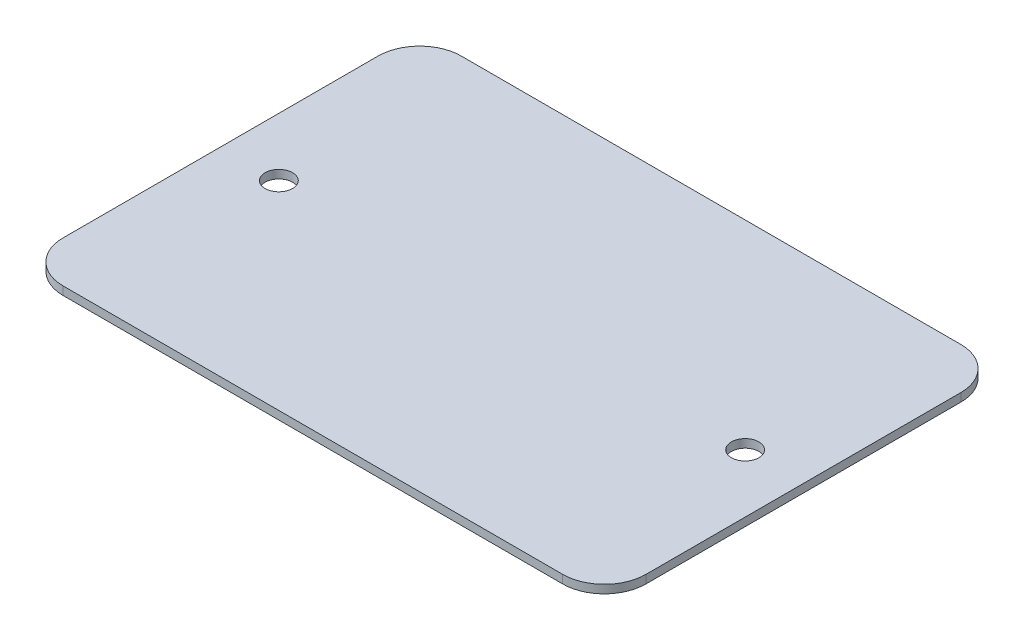
ISO-10303-21;
HEADER;
FILE_DESCRIPTION(('STEP AP214'),'2;1');
FILE_NAME('part.step','',(''),(''),'','','');
FILE_SCHEMA(('AUTOMOTIVE_DESIGN { 1 0 10303 214 1 1 1 1 }'));
ENDSEC;
DATA;
#1=APPLICATION_CONTEXT('core data for automotive mechanical design processes');
#2=APPLICATION_PROTOCOL_DEFINITION('international standard','automotive_design',2000,#1);
#3=PRODUCT_CONTEXT('',#1,'mechanical');
#4=PRODUCT('Part','Part','',(#3));
#5=PRODUCT_RELATED_PRODUCT_CATEGORY('part','',(#4));
#6=PRODUCT_DEFINITION_FORMATION('','',#4);
#7=PRODUCT_DEFINITION_CONTEXT('part definition',#1,'design');
#8=PRODUCT_DEFINITION('design','',#6,#7);
#9=PRODUCT_DEFINITION_SHAPE('','',#8);
#10=(LENGTH_UNIT() NAMED_UNIT(*) SI_UNIT(.MILLI.,.METRE.));
#11=(NAMED_UNIT(*) PLANE_ANGLE_UNIT() SI_UNIT($,.RADIAN.));
#12=(NAMED_UNIT(*) SI_UNIT($,.STERADIAN.) SOLID_ANGLE_UNIT());
#13=UNCERTAINTY_MEASURE_WITH_UNIT(LENGTH_MEASURE(1.E-05),#10,'distance_accuracy_value','');
#14=(GEOMETRIC_REPRESENTATION_CONTEXT(3) GLOBAL_UNCERTAINTY_ASSIGNED_CONTEXT((#13)) GLOBAL_UNIT_ASSIGNED_CONTEXT((#10,
#11,#12)) REPRESENTATION_CONTEXT('',''));
#15=CARTESIAN_POINT('',(0.,0.,0.));
#16=DIRECTION('',(0.,0.,1.));
#17=DIRECTION('',(1.,0.,0.));
#18=AXIS2_PLACEMENT_3D('',#15,#16,#17);
#19=CARTESIAN_POINT('',(6.10297775867225,1.,0.));
#20=DIRECTION('',(-1.,0.,0.));
#21=DIRECTION('',(0.,0.,1.));
#22=AXIS2_PLACEMENT_3D('',#19,#20,#21);
#23=PLANE('',#22);
#24=DIRECTION('',(0.,0.,-1.));
#25=VECTOR('',#24,1.);
#26=CARTESIAN_POINT('',(6.10297775867225,0.,0.));
#27=LINE('',#26,#25);
#28=CARTESIAN_POINT('',(6.10297775867225,0.,30.5092870943281));
#29=VERTEX_POINT('',#28);
#30=CARTESIAN_POINT('',(6.10297775867225,0.,-7.31135153699148));
#31=VERTEX_POINT('',#30);
#32=EDGE_CURVE('E134',#29,#31,#27,.T.);
#33=ORIENTED_EDGE('',*,*,#32,.T.);
#34=DIRECTION('',(0.,-1.,0.));
#35=VECTOR('',#34,1.);
#36=CARTESIAN_POINT('',(6.10297775867225,1.,-7.31135153699148));
#37=LINE('',#36,#35);
#38=CARTESIAN_POINT('',(6.10297775867225,1.,-7.31135153699148));
#39=VERTEX_POINT('',#38);
#40=EDGE_CURVE('E112',#31,#39,#37,.F.);
#41=ORIENTED_EDGE('',*,*,#40,.T.);
#42=DIRECTION('',(0.,0.,-1.));
#43=VECTOR('',#42,1.);
#44=CARTESIAN_POINT('',(6.10297775867225,1.,0.));
#45=LINE('',#44,#43);
#46=CARTESIAN_POINT('',(6.10297775867225,1.,30.5092870943281));
#47=VERTEX_POINT('',#46);
#48=EDGE_CURVE('E144',#47,#39,#45,.T.);
#49=ORIENTED_EDGE('',*,*,#48,.F.);
#50=DIRECTION('',(0.,-1.,0.));
#51=VECTOR('',#50,1.);
#52=CARTESIAN_POINT('',(6.10297775867225,1.,30.5092870943281));
#53=LINE('',#52,#51);
#54=EDGE_CURVE('E117',#47,#29,#53,.T.);
#55=ORIENTED_EDGE('',*,*,#54,.T.);
#56=EDGE_LOOP('',(#33,#41,#49,#55));
#57=FACE_BOUND('',#56,.T.);
#58=ADVANCED_FACE('F39',(#57),#23,.F.);
#59=CARTESIAN_POINT('',(0.,1.,-12.3113515369915));
#60=DIRECTION('',(0.,0.,1.));
#61=DIRECTION('',(1.,0.,0.));
#62=AXIS2_PLACEMENT_3D('',#59,#60,#61);
#63=PLANE('',#62);
#64=DIRECTION('',(-1.,0.,0.));
#65=VECTOR('',#64,1.);
#66=CARTESIAN_POINT('',(0.,1.,-12.3113515369915));
#67=LINE('',#66,#65);
#68=CARTESIAN_POINT('',(1.10297775867225,1.,-12.3113515369915));
#69=VERTEX_POINT('',#68);
#70=CARTESIAN_POINT('',(-58.8970222413278,1.,-12.3113515369915));
#71=VERTEX_POINT('',#70);
#72=EDGE_CURVE('E127',#69,#71,#67,.T.);
#73=ORIENTED_EDGE('',*,*,#72,.F.);
#74=DIRECTION('',(0.,-1.,0.));
#75=VECTOR('',#74,1.);
#76=CARTESIAN_POINT('',(1.10297775867225,1.,-12.3113515369915));
#77=LINE('',#76,#75);
#78=CARTESIAN_POINT('',(1.10297775867225,0.,-12.3113515369915));
#79=VERTEX_POINT('',#78);
#80=EDGE_CURVE('E111',#69,#79,#77,.T.);
#81=ORIENTED_EDGE('',*,*,#80,.T.);
#82=DIRECTION('',(-1.,0.,0.));
#83=VECTOR('',#82,1.);
#84=CARTESIAN_POINT('',(0.,0.,-12.3113515369915));
#85=LINE('',#84,#83);
#86=CARTESIAN_POINT('',(-58.8970222413278,0.,-12.3113515369915));
#87=VERTEX_POINT('',#86);
#88=EDGE_CURVE('E124',#79,#87,#85,.T.);
#89=ORIENTED_EDGE('',*,*,#88,.T.);
#90=DIRECTION('',(0.,-1.,0.));
#91=VECTOR('',#90,1.);
#92=CARTESIAN_POINT('',(-58.8970222413278,1.,-12.3113515369915));
#93=LINE('',#92,#91);
#94=EDGE_CURVE('E129',#87,#71,#93,.F.);
#95=ORIENTED_EDGE('',*,*,#94,.T.);
#96=EDGE_LOOP('',(#73,#81,#89,#95));
#97=FACE_BOUND('',#96,.T.);
#98=ADVANCED_FACE('F123',(#97),#63,.F.);
#99=CARTESIAN_POINT('',(-63.8970222413278,1.,0.));
#100=DIRECTION('',(1.,0.,0.));
#101=DIRECTION('',(0.,0.,-1.));
#102=AXIS2_PLACEMENT_3D('',#99,#100,#101);
#103=PLANE('',#102);
#104=DIRECTION('',(0.,0.,1.));
#105=VECTOR('',#104,1.);
#106=CARTESIAN_POINT('',(-63.8970222413278,1.,0.));
#107=LINE('',#106,#105);
#108=CARTESIAN_POINT('',(-63.8970222413278,1.,-7.31135153699148));
#109=VERTEX_POINT('',#108);
#110=CARTESIAN_POINT('',(-63.8970222413278,1.,30.5092870943281));
#111=VERTEX_POINT('',#110);
#112=EDGE_CURVE('E181',#109,#111,#107,.T.);
#113=ORIENTED_EDGE('',*,*,#112,.F.);
#114=DIRECTION('',(0.,-1.,0.));
#115=VECTOR('',#114,1.);
#116=CARTESIAN_POINT('',(-63.8970222413278,1.,-7.31135153699148));
#117=LINE('',#116,#115);
#118=CARTESIAN_POINT('',(-63.8970222413278,0.,-7.31135153699148));
#119=VERTEX_POINT('',#118);
#120=EDGE_CURVE('E163',#109,#119,#117,.T.);
#121=ORIENTED_EDGE('',*,*,#120,.T.);
#122=DIRECTION('',(0.,0.,1.));
#123=VECTOR('',#122,1.);
#124=CARTESIAN_POINT('',(-63.8970222413278,0.,0.));
#125=LINE('',#124,#123);
#126=CARTESIAN_POINT('',(-63.8970222413278,0.,30.5092870943281));
#127=VERTEX_POINT('',#126);
#128=EDGE_CURVE('E133',#119,#127,#125,.T.);
#129=ORIENTED_EDGE('',*,*,#128,.T.);
#130=DIRECTION('',(0.,-1.,0.));
#131=VECTOR('',#130,1.);
#132=CARTESIAN_POINT('',(-63.8970222413278,1.,30.5092870943281));
#133=LINE('',#132,#131);
#134=EDGE_CURVE('E161',#127,#111,#133,.F.);
#135=ORIENTED_EDGE('',*,*,#134,.T.);
#136=EDGE_LOOP('',(#113,#121,#129,#135));
#137=FACE_BOUND('',#136,.T.);
#138=ADVANCED_FACE('F196',(#137),#103,.F.);
#139=CARTESIAN_POINT('',(0.,1.,35.5092870943281));
#140=DIRECTION('',(0.,0.,-1.));
#141=DIRECTION('',(-1.,0.,0.));
#142=AXIS2_PLACEMENT_3D('',#139,#140,#141);
#143=PLANE('',#142);
#144=DIRECTION('',(1.,0.,0.));
#145=VECTOR('',#144,1.);
#146=CARTESIAN_POINT('',(0.,1.,35.5092870943281));
#147=LINE('',#146,#145);
#148=CARTESIAN_POINT('',(-58.8970222413278,1.,35.5092870943281));
#149=VERTEX_POINT('',#148);
#150=CARTESIAN_POINT('',(1.10297775867225,1.,35.5092870943281));
#151=VERTEX_POINT('',#150);
#152=EDGE_CURVE('E145',#149,#151,#147,.T.);
#153=ORIENTED_EDGE('',*,*,#152,.F.);
#154=DIRECTION('',(0.,-1.,0.));
#155=VECTOR('',#154,1.);
#156=CARTESIAN_POINT('',(-58.8970222413278,1.,35.5092870943281));
#157=LINE('',#156,#155);
#158=CARTESIAN_POINT('',(-58.8970222413278,0.,35.5092870943281));
#159=VERTEX_POINT('',#158);
#160=EDGE_CURVE('E11',#149,#159,#157,.T.);
#161=ORIENTED_EDGE('',*,*,#160,.T.);
#162=DIRECTION('',(1.,0.,0.));
#163=VECTOR('',#162,1.);
#164=CARTESIAN_POINT('',(0.,0.,35.5092870943281));
#165=LINE('',#164,#163);
#166=CARTESIAN_POINT('',(1.10297775867225,0.,35.5092870943281));
#167=VERTEX_POINT('',#166);
#168=EDGE_CURVE('E137',#159,#167,#165,.T.);
#169=ORIENTED_EDGE('',*,*,#168,.T.);
#170=DIRECTION('',(0.,-1.,0.));
#171=VECTOR('',#170,1.);
#172=CARTESIAN_POINT('',(1.10297775867225,1.,35.5092870943281));
#173=LINE('',#172,#171);
#174=EDGE_CURVE('E48',#167,#151,#173,.F.);
#175=ORIENTED_EDGE('',*,*,#174,.T.);
#176=EDGE_LOOP('',(#153,#161,#169,#175));
#177=FACE_BOUND('',#176,.T.);
#178=ADVANCED_FACE('F190',(#177),#143,.F.);
#179=CARTESIAN_POINT('',(0.,1.,0.));
#180=DIRECTION('',(0.,1.,0.));
#181=DIRECTION('',(0.,0.,1.));
#182=AXIS2_PLACEMENT_3D('',#179,#180,#181);
#183=PLANE('',#182);
#184=CARTESIAN_POINT('',(-56.8970222413278,1.,11.5989677786683));
#185=DIRECTION('',(0.,1.,0.));
#186=DIRECTION('',(0.,0.,1.));
#187=AXIS2_PLACEMENT_3D('',#184,#185,#186);
#188=CIRCLE('',#187,1.65);
#189=CARTESIAN_POINT('',(-56.8970222413278,1.,13.2489677786683));
#190=VERTEX_POINT('',#189);
#191=EDGE_CURVE('E175',#190,#190,#188,.T.);
#192=ORIENTED_EDGE('',*,*,#191,.F.);
#193=EDGE_LOOP('',(#192));
#194=FACE_BOUND('',#193,.T.);
#195=CARTESIAN_POINT('',(-0.897022241327755,1.,11.5989677786683));
#196=DIRECTION('',(0.,1.,0.));
#197=DIRECTION('',(0.,0.,1.));
#198=AXIS2_PLACEMENT_3D('',#195,#196,#197);
#199=CIRCLE('',#198,1.65);
#200=CARTESIAN_POINT('',(-0.897022241327755,1.,13.2489677786683));
#201=VERTEX_POINT('',#200);
#202=EDGE_CURVE('E167',#201,#201,#199,.T.);
#203=ORIENTED_EDGE('',*,*,#202,.F.);
#204=EDGE_LOOP('',(#203));
#205=FACE_BOUND('',#204,.T.);
#206=ORIENTED_EDGE('',*,*,#48,.T.);
#207=CARTESIAN_POINT('',(1.10297775867225,1.,-7.31135153699148));
#208=DIRECTION('',(0.,1.,0.));
#209=DIRECTION('',(0.,0.,1.));
#210=AXIS2_PLACEMENT_3D('',#207,#208,#209);
#211=CIRCLE('',#210,5.);
#212=EDGE_CURVE('E159',#39,#69,#211,.T.);
#213=ORIENTED_EDGE('',*,*,#212,.T.);
#214=ORIENTED_EDGE('',*,*,#72,.T.);
#215=CARTESIAN_POINT('',(-58.8970222413278,1.,-7.31135153699148));
#216=DIRECTION('',(0.,1.,0.));
#217=DIRECTION('',(0.,0.,1.));
#218=AXIS2_PLACEMENT_3D('',#215,#216,#217);
#219=CIRCLE('',#218,5.);
#220=EDGE_CURVE('E157',#71,#109,#219,.T.);
#221=ORIENTED_EDGE('',*,*,#220,.T.);
#222=ORIENTED_EDGE('',*,*,#112,.T.);
#223=CARTESIAN_POINT('',(-58.8970222413278,1.,30.5092870943281));
#224=DIRECTION('',(0.,1.,0.));
#225=DIRECTION('',(0.,0.,1.));
#226=AXIS2_PLACEMENT_3D('',#223,#224,#225);
#227=CIRCLE('',#226,5.);
#228=EDGE_CURVE('E62',#111,#149,#227,.T.);
#229=ORIENTED_EDGE('',*,*,#228,.T.);
#230=ORIENTED_EDGE('',*,*,#152,.T.);
#231=CARTESIAN_POINT('',(1.10297775867225,1.,30.5092870943281));
#232=DIRECTION('',(0.,1.,0.));
#233=DIRECTION('',(0.,0.,1.));
#234=AXIS2_PLACEMENT_3D('',#231,#232,#233);
#235=CIRCLE('',#234,5.);
#236=EDGE_CURVE('E154',#151,#47,#235,.T.);
#237=ORIENTED_EDGE('',*,*,#236,.T.);
#238=EDGE_LOOP('',(#206,#213,#214,#221,#222,#229,#230,#237));
#239=FACE_BOUND('',#238,.T.);
#240=ADVANCED_FACE('F183',(#194,#205,#239),#183,.T.);
#241=CARTESIAN_POINT('',(0.,0.,0.));
#242=DIRECTION('',(0.,1.,0.));
#243=DIRECTION('',(0.,0.,1.));
#244=AXIS2_PLACEMENT_3D('',#241,#242,#243);
#245=PLANE('',#244);
#246=CARTESIAN_POINT('',(-56.8970222413278,0.,11.5989677786683));
#247=DIRECTION('',(0.,1.,0.));
#248=DIRECTION('',(0.,0.,1.));
#249=AXIS2_PLACEMENT_3D('',#246,#247,#248);
#250=CIRCLE('',#249,1.65);
#251=CARTESIAN_POINT('',(-56.8970222413278,0.,13.2489677786683));
#252=VERTEX_POINT('',#251);
#253=EDGE_CURVE('E43',#252,#252,#250,.T.);
#254=ORIENTED_EDGE('',*,*,#253,.T.);
#255=EDGE_LOOP('',(#254));
#256=FACE_BOUND('',#255,.T.);
#257=CARTESIAN_POINT('',(-0.897022241327755,0.,11.5989677786683));
#258=DIRECTION('',(0.,1.,0.));
#259=DIRECTION('',(0.,0.,1.));
#260=AXIS2_PLACEMENT_3D('',#257,#258,#259);
#261=CIRCLE('',#260,1.65);
#262=CARTESIAN_POINT('',(-0.897022241327755,0.,13.2489677786683));
#263=VERTEX_POINT('',#262);
#264=EDGE_CURVE('E139',#263,#263,#261,.T.);
#265=ORIENTED_EDGE('',*,*,#264,.T.);
#266=EDGE_LOOP('',(#265));
#267=FACE_BOUND('',#266,.T.);
#268=ORIENTED_EDGE('',*,*,#88,.F.);
#269=CARTESIAN_POINT('',(1.10297775867225,0.,-7.31135153699148));
#270=DIRECTION('',(0.,1.,0.));
#271=DIRECTION('',(0.,0.,1.));
#272=AXIS2_PLACEMENT_3D('',#269,#270,#271);
#273=CIRCLE('',#272,5.);
#274=EDGE_CURVE('E107',#79,#31,#273,.F.);
#275=ORIENTED_EDGE('',*,*,#274,.T.);
#276=ORIENTED_EDGE('',*,*,#32,.F.);
#277=CARTESIAN_POINT('',(1.10297775867225,0.,30.5092870943281));
#278=DIRECTION('',(0.,1.,0.));
#279=DIRECTION('',(0.,0.,1.));
#280=AXIS2_PLACEMENT_3D('',#277,#278,#279);
#281=CIRCLE('',#280,5.);
#282=EDGE_CURVE('E128',#29,#167,#281,.F.);
#283=ORIENTED_EDGE('',*,*,#282,.T.);
#284=ORIENTED_EDGE('',*,*,#168,.F.);
#285=CARTESIAN_POINT('',(-58.8970222413278,0.,30.5092870943281));
#286=DIRECTION('',(0.,1.,0.));
#287=DIRECTION('',(0.,0.,1.));
#288=AXIS2_PLACEMENT_3D('',#285,#286,#287);
#289=CIRCLE('',#288,5.);
#290=EDGE_CURVE('E148',#159,#127,#289,.F.);
#291=ORIENTED_EDGE('',*,*,#290,.T.);
#292=ORIENTED_EDGE('',*,*,#128,.F.);
#293=CARTESIAN_POINT('',(-58.8970222413278,0.,-7.31135153699148));
#294=DIRECTION('',(0.,1.,0.));
#295=DIRECTION('',(0.,0.,1.));
#296=AXIS2_PLACEMENT_3D('',#293,#294,#295);
#297=CIRCLE('',#296,5.);
#298=EDGE_CURVE('E118',#119,#87,#297,.F.);
#299=ORIENTED_EDGE('',*,*,#298,.T.);
#300=EDGE_LOOP('',(#268,#275,#276,#283,#284,#291,#292,#299));
#301=FACE_BOUND('',#300,.T.);
#302=ADVANCED_FACE('F131',(#256,#267,#301),#245,.F.);
#303=CARTESIAN_POINT('',(1.10297775867225,1.,-7.31135153699148));
#304=DIRECTION('',(0.,-1.,0.));
#305=DIRECTION('',(0.,0.,-1.));
#306=AXIS2_PLACEMENT_3D('',#303,#304,#305);
#307=CYLINDRICAL_SURFACE('',#306,5.);
#308=ORIENTED_EDGE('',*,*,#212,.F.);
#309=ORIENTED_EDGE('',*,*,#40,.F.);
#310=ORIENTED_EDGE('',*,*,#274,.F.);
#311=ORIENTED_EDGE('',*,*,#80,.F.);
#312=EDGE_LOOP('',(#308,#309,#310,#311));
#313=FACE_BOUND('',#312,.T.);
#314=ADVANCED_FACE('F110',(#313),#307,.T.);
#315=CARTESIAN_POINT('',(-58.8970222413278,1.,-7.31135153699148));
#316=DIRECTION('',(0.,-1.,0.));
#317=DIRECTION('',(0.,0.,-1.));
#318=AXIS2_PLACEMENT_3D('',#315,#316,#317);
#319=CYLINDRICAL_SURFACE('',#318,5.);
#320=ORIENTED_EDGE('',*,*,#220,.F.);
#321=ORIENTED_EDGE('',*,*,#94,.F.);
#322=ORIENTED_EDGE('',*,*,#298,.F.);
#323=ORIENTED_EDGE('',*,*,#120,.F.);
#324=EDGE_LOOP('',(#320,#321,#322,#323));
#325=FACE_BOUND('',#324,.T.);
#326=ADVANCED_FACE('F200',(#325),#319,.T.);
#327=CARTESIAN_POINT('',(-58.8970222413278,1.,30.5092870943281));
#328=DIRECTION('',(0.,-1.,0.));
#329=DIRECTION('',(0.,0.,-1.));
#330=AXIS2_PLACEMENT_3D('',#327,#328,#329);
#331=CYLINDRICAL_SURFACE('',#330,5.);
#332=ORIENTED_EDGE('',*,*,#228,.F.);
#333=ORIENTED_EDGE('',*,*,#134,.F.);
#334=ORIENTED_EDGE('',*,*,#290,.F.);
#335=ORIENTED_EDGE('',*,*,#160,.F.);
#336=EDGE_LOOP('',(#332,#333,#334,#335));
#337=FACE_BOUND('',#336,.T.);
#338=ADVANCED_FACE('F192',(#337),#331,.T.);
#339=CARTESIAN_POINT('',(1.10297775867225,1.,30.5092870943281));
#340=DIRECTION('',(0.,-1.,0.));
#341=DIRECTION('',(0.,0.,-1.));
#342=AXIS2_PLACEMENT_3D('',#339,#340,#341);
#343=CYLINDRICAL_SURFACE('',#342,5.);
#344=ORIENTED_EDGE('',*,*,#236,.F.);
#345=ORIENTED_EDGE('',*,*,#174,.F.);
#346=ORIENTED_EDGE('',*,*,#282,.F.);
#347=ORIENTED_EDGE('',*,*,#54,.F.);
#348=EDGE_LOOP('',(#344,#345,#346,#347));
#349=FACE_BOUND('',#348,.T.);
#350=ADVANCED_FACE('F41',(#349),#343,.T.);
#351=CARTESIAN_POINT('',(-0.897022241327755,1.,11.5989677786683));
#352=DIRECTION('',(0.,1.,0.));
#353=DIRECTION('',(0.,0.,1.));
#354=AXIS2_PLACEMENT_3D('',#351,#352,#353);
#355=CYLINDRICAL_SURFACE('',#354,1.65);
#356=ORIENTED_EDGE('',*,*,#202,.T.);
#357=EDGE_LOOP('',(#356));
#358=FACE_BOUND('',#357,.T.);
#359=ORIENTED_EDGE('',*,*,#264,.F.);
#360=EDGE_LOOP('',(#359));
#361=FACE_BOUND('',#360,.T.);
#362=ADVANCED_FACE('F225',(#358,#361),#355,.F.);
#363=CARTESIAN_POINT('',(-56.8970222413278,1.,11.5989677786683));
#364=DIRECTION('',(0.,1.,0.));
#365=DIRECTION('',(0.,0.,1.));
#366=AXIS2_PLACEMENT_3D('',#363,#364,#365);
#367=CYLINDRICAL_SURFACE('',#366,1.65);
#368=ORIENTED_EDGE('',*,*,#191,.T.);
#369=EDGE_LOOP('',(#368));
#370=FACE_BOUND('',#369,.T.);
#371=ORIENTED_EDGE('',*,*,#253,.F.);
#372=EDGE_LOOP('',(#371));
#373=FACE_BOUND('',#372,.T.);
#374=ADVANCED_FACE('F228',(#370,#373),#367,.F.);
#375=CLOSED_SHELL('',(#58,#98,#138,#178,#240,#302,#314,#326,#338,#350,#362,#374));
#376=MANIFOLD_SOLID_BREP('B2',#375);
#377=ADVANCED_BREP_SHAPE_REPRESENTATION('',(#18,#376),#14);
#378=SHAPE_DEFINITION_REPRESENTATION(#9,#377);
ENDSEC;
END-ISO-10303-21;
